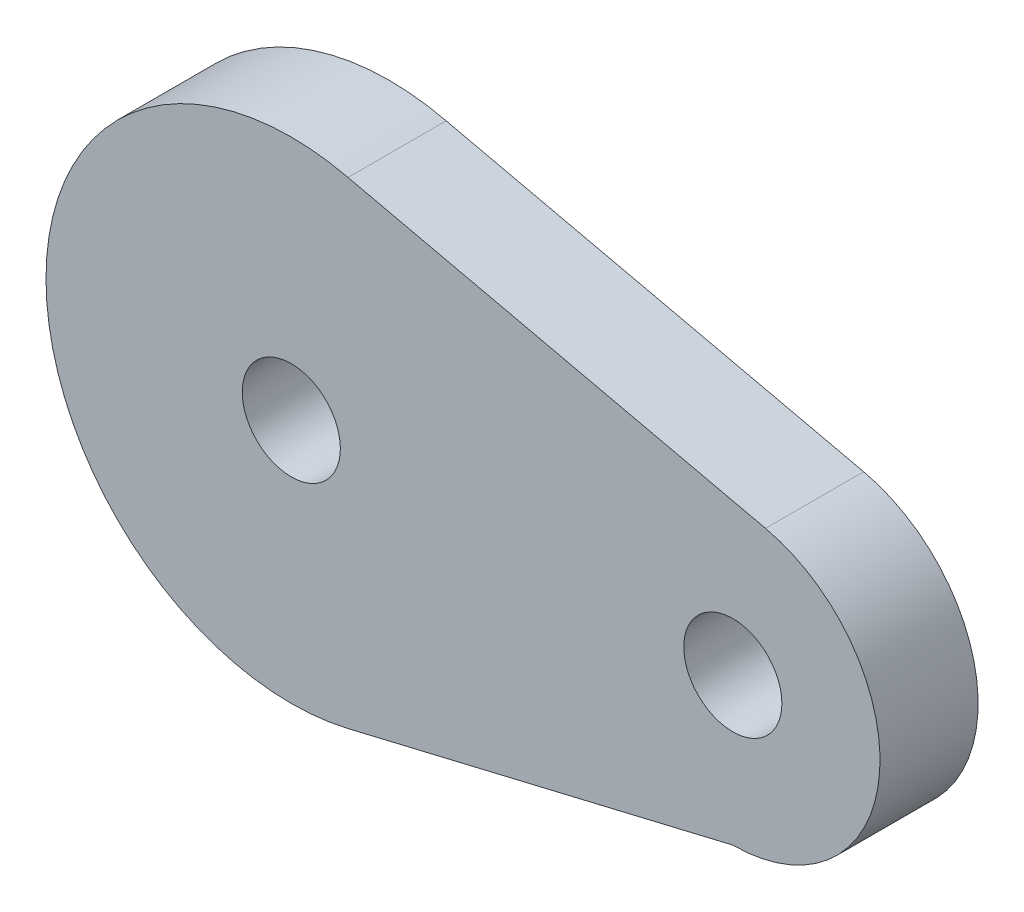
ISO-10303-21;
HEADER;
FILE_DESCRIPTION(('STEP AP214'),'2;1');
FILE_NAME('part.step','',(''),(''),'','','');
FILE_SCHEMA(('AUTOMOTIVE_DESIGN { 1 0 10303 214 1 1 1 1 }'));
ENDSEC;
DATA;
#1=APPLICATION_CONTEXT('core data for automotive mechanical design processes');
#2=APPLICATION_PROTOCOL_DEFINITION('international standard','automotive_design',2000,#1);
#3=PRODUCT_CONTEXT('',#1,'mechanical');
#4=PRODUCT('Part','Part','',(#3));
#5=PRODUCT_RELATED_PRODUCT_CATEGORY('part','',(#4));
#6=PRODUCT_DEFINITION_FORMATION('','',#4);
#7=PRODUCT_DEFINITION_CONTEXT('part definition',#1,'design');
#8=PRODUCT_DEFINITION('design','',#6,#7);
#9=PRODUCT_DEFINITION_SHAPE('','',#8);
#10=(LENGTH_UNIT() NAMED_UNIT(*) SI_UNIT(.MILLI.,.METRE.));
#11=(NAMED_UNIT(*) PLANE_ANGLE_UNIT() SI_UNIT($,.RADIAN.));
#12=(NAMED_UNIT(*) SI_UNIT($,.STERADIAN.) SOLID_ANGLE_UNIT());
#13=UNCERTAINTY_MEASURE_WITH_UNIT(LENGTH_MEASURE(1.E-05),#10,'distance_accuracy_value','');
#14=(GEOMETRIC_REPRESENTATION_CONTEXT(3) GLOBAL_UNCERTAINTY_ASSIGNED_CONTEXT((#13)) GLOBAL_UNIT_ASSIGNED_CONTEXT((#10,
#11,#12)) REPRESENTATION_CONTEXT('',''));
#15=CARTESIAN_POINT('',(0.,0.,0.));
#16=DIRECTION('',(0.,0.,1.));
#17=DIRECTION('',(1.,0.,0.));
#18=AXIS2_PLACEMENT_3D('',#15,#16,#17);
#19=CARTESIAN_POINT('',(0.,0.,10.));
#20=DIRECTION('',(0.,0.,1.));
#21=DIRECTION('',(1.,0.,0.));
#22=AXIS2_PLACEMENT_3D('',#19,#20,#21);
#23=PLANE('',#22);
#24=CARTESIAN_POINT('',(45.,0.,10.));
#25=DIRECTION('',(0.,0.,1.));
#26=DIRECTION('',(1.,0.,0.));
#27=AXIS2_PLACEMENT_3D('',#24,#25,#26);
#28=CIRCLE('',#27,5.);
#29=CARTESIAN_POINT('',(50.,0.,10.));
#30=VERTEX_POINT('',#29);
#31=EDGE_CURVE('E124',#30,#30,#28,.T.);
#32=ORIENTED_EDGE('',*,*,#31,.F.);
#33=EDGE_LOOP('',(#32));
#34=FACE_BOUND('',#33,.T.);
#35=CARTESIAN_POINT('',(0.,0.,10.));
#36=DIRECTION('',(0.,0.,1.));
#37=DIRECTION('',(1.,0.,0.));
#38=AXIS2_PLACEMENT_3D('',#35,#36,#37);
#39=CIRCLE('',#38,5.);
#40=CARTESIAN_POINT('',(5.,0.,10.));
#41=VERTEX_POINT('',#40);
#42=EDGE_CURVE('E13',#41,#41,#39,.T.);
#43=ORIENTED_EDGE('',*,*,#42,.F.);
#44=EDGE_LOOP('',(#43));
#45=FACE_BOUND('',#44,.T.);
#46=DIRECTION('',(-0.975001521058085,0.22219818616366,0.));
#47=VECTOR('',#46,1.);
#48=CARTESIAN_POINT('',(5.55471431952425,24.3739834428272,10.));
#49=LINE('',#48,#47);
#50=CARTESIAN_POINT('',(48.3329727925334,14.6250228159478,9.99999999999999));
#51=VERTEX_POINT('',#50);
#52=CARTESIAN_POINT('',(5.78145187656567,24.3223110373779,10.));
#53=VERTEX_POINT('',#52);
#54=EDGE_CURVE('E116',#51,#53,#49,.T.);
#55=ORIENTED_EDGE('',*,*,#54,.T.);
#56=CARTESIAN_POINT('',(0.,0.,9.99999999999999));
#57=DIRECTION('',(0.,0.,1.));
#58=DIRECTION('',(1.,0.,0.));
#59=AXIS2_PLACEMENT_3D('',#56,#57,#58);
#60=CIRCLE('',#59,25.);
#61=CARTESIAN_POINT('',(5.78145187656567,-24.3223110373779,9.99999999999999));
#62=VERTEX_POINT('',#61);
#63=EDGE_CURVE('E121',#53,#62,#60,.T.);
#64=ORIENTED_EDGE('',*,*,#63,.T.);
#65=DIRECTION('',(0.972892441495116,0.231258075062627,0.));
#66=VECTOR('',#65,1.);
#67=CARTESIAN_POINT('',(5.78145187656567,-24.3223110373779,10.));
#68=LINE('',#67,#66);
#69=CARTESIAN_POINT('',(45.0000000001009,-14.9999999997242,9.99999999999999));
#70=VERTEX_POINT('',#69);
#71=EDGE_CURVE('E119',#62,#70,#68,.T.);
#72=ORIENTED_EDGE('',*,*,#71,.T.);
#73=CARTESIAN_POINT('',(45.0000000001009,1.74860471300846E-10,9.99999999999999));
#74=DIRECTION('',(0.,0.,1.));
#75=DIRECTION('',(1.,0.,0.));
#76=AXIS2_PLACEMENT_3D('',#73,#74,#75);
#77=CIRCLE('',#76,14.9999999998991);
#78=EDGE_CURVE('E91',#70,#51,#77,.T.);
#79=ORIENTED_EDGE('',*,*,#78,.T.);
#80=EDGE_LOOP('',(#55,#64,#72,#79));
#81=FACE_BOUND('',#80,.T.);
#82=ADVANCED_FACE('F45',(#34,#45,#81),#23,.T.);
#83=CARTESIAN_POINT('',(0.,0.,0.));
#84=DIRECTION('',(0.,0.,1.));
#85=DIRECTION('',(1.,0.,0.));
#86=AXIS2_PLACEMENT_3D('',#83,#84,#85);
#87=PLANE('',#86);
#88=CARTESIAN_POINT('',(0.,0.,0.));
#89=DIRECTION('',(0.,0.,1.));
#90=DIRECTION('',(1.,0.,0.));
#91=AXIS2_PLACEMENT_3D('',#88,#89,#90);
#92=CIRCLE('',#91,5.);
#93=CARTESIAN_POINT('',(5.,0.,0.));
#94=VERTEX_POINT('',#93);
#95=EDGE_CURVE('E54',#94,#94,#92,.T.);
#96=ORIENTED_EDGE('',*,*,#95,.T.);
#97=EDGE_LOOP('',(#96));
#98=FACE_BOUND('',#97,.T.);
#99=CARTESIAN_POINT('',(45.,0.,0.));
#100=DIRECTION('',(0.,0.,1.));
#101=DIRECTION('',(1.,0.,0.));
#102=AXIS2_PLACEMENT_3D('',#99,#100,#101);
#103=CIRCLE('',#102,5.);
#104=CARTESIAN_POINT('',(50.,0.,0.));
#105=VERTEX_POINT('',#104);
#106=EDGE_CURVE('E49',#105,#105,#103,.T.);
#107=ORIENTED_EDGE('',*,*,#106,.T.);
#108=EDGE_LOOP('',(#107));
#109=FACE_BOUND('',#108,.T.);
#110=CARTESIAN_POINT('',(0.,0.,0.));
#111=DIRECTION('',(0.,0.,-1.));
#112=DIRECTION('',(-1.,0.,0.));
#113=AXIS2_PLACEMENT_3D('',#110,#111,#112);
#114=CIRCLE('',#113,25.);
#115=CARTESIAN_POINT('',(5.78145187656567,-24.3223110373779,0.));
#116=VERTEX_POINT('',#115);
#117=CARTESIAN_POINT('',(5.78145187656567,24.3223110373779,0.));
#118=VERTEX_POINT('',#117);
#119=EDGE_CURVE('E108',#116,#118,#114,.T.);
#120=ORIENTED_EDGE('',*,*,#119,.T.);
#121=DIRECTION('',(0.975001521058085,-0.222198186163659,0.));
#122=VECTOR('',#121,1.);
#123=CARTESIAN_POINT('',(5.78145187656567,24.3223110373779,0.));
#124=LINE('',#123,#122);
#125=CARTESIAN_POINT('',(48.3329727925334,14.6250228159478,0.));
#126=VERTEX_POINT('',#125);
#127=EDGE_CURVE('E106',#118,#126,#124,.T.);
#128=ORIENTED_EDGE('',*,*,#127,.T.);
#129=CARTESIAN_POINT('',(45.0000000001009,1.74860471300846E-10,0.));
#130=DIRECTION('',(0.,0.,-1.));
#131=DIRECTION('',(-1.,0.,0.));
#132=AXIS2_PLACEMENT_3D('',#129,#130,#131);
#133=CIRCLE('',#132,14.9999999998991);
#134=CARTESIAN_POINT('',(45.0000000001009,-14.9999999997242,0.));
#135=VERTEX_POINT('',#134);
#136=EDGE_CURVE('E70',#126,#135,#133,.T.);
#137=ORIENTED_EDGE('',*,*,#136,.T.);
#138=DIRECTION('',(-0.972892441495116,-0.231258075062627,0.));
#139=VECTOR('',#138,1.);
#140=CARTESIAN_POINT('',(5.78145187656567,-24.3223110373779,0.));
#141=LINE('',#140,#139);
#142=EDGE_CURVE('E98',#135,#116,#141,.T.);
#143=ORIENTED_EDGE('',*,*,#142,.T.);
#144=EDGE_LOOP('',(#120,#128,#137,#143));
#145=FACE_BOUND('',#144,.T.);
#146=ADVANCED_FACE('F47',(#98,#109,#145),#87,.F.);
#147=CARTESIAN_POINT('',(0.,0.,10.));
#148=DIRECTION('',(0.,0.,-1.));
#149=DIRECTION('',(-1.,0.,0.));
#150=AXIS2_PLACEMENT_3D('',#147,#148,#149);
#151=CYLINDRICAL_SURFACE('',#150,5.);
#152=ORIENTED_EDGE('',*,*,#42,.T.);
#153=EDGE_LOOP('',(#152));
#154=FACE_BOUND('',#153,.T.);
#155=ORIENTED_EDGE('',*,*,#95,.F.);
#156=EDGE_LOOP('',(#155));
#157=FACE_BOUND('',#156,.T.);
#158=ADVANCED_FACE('F135',(#154,#157),#151,.F.);
#159=CARTESIAN_POINT('',(45.,0.,-22.));
#160=DIRECTION('',(0.,0.,1.));
#161=DIRECTION('',(1.,0.,0.));
#162=AXIS2_PLACEMENT_3D('',#159,#160,#161);
#163=CYLINDRICAL_SURFACE('',#162,5.);
#164=ORIENTED_EDGE('',*,*,#31,.T.);
#165=EDGE_LOOP('',(#164));
#166=FACE_BOUND('',#165,.T.);
#167=ORIENTED_EDGE('',*,*,#106,.F.);
#168=EDGE_LOOP('',(#167));
#169=FACE_BOUND('',#168,.T.);
#170=ADVANCED_FACE('F133',(#166,#169),#163,.F.);
#171=CARTESIAN_POINT('',(45.0000000001009,1.74860471300846E-10,130.));
#172=DIRECTION('',(0.,0.,-1.));
#173=DIRECTION('',(-1.,0.,0.));
#174=AXIS2_PLACEMENT_3D('',#171,#172,#173);
#175=CYLINDRICAL_SURFACE('',#174,14.9999999998991);
#176=DIRECTION('',(0.,0.,-1.));
#177=VECTOR('',#176,1.);
#178=CARTESIAN_POINT('',(45.0000000001009,-14.9999999997242,130.));
#179=LINE('',#178,#177);
#180=EDGE_CURVE('E88',#70,#135,#179,.T.);
#181=ORIENTED_EDGE('',*,*,#180,.T.);
#182=ORIENTED_EDGE('',*,*,#136,.F.);
#183=DIRECTION('',(0.,0.,-1.));
#184=VECTOR('',#183,1.);
#185=CARTESIAN_POINT('',(48.3329727925334,14.6250228159478,130.));
#186=LINE('',#185,#184);
#187=EDGE_CURVE('E95',#51,#126,#186,.T.);
#188=ORIENTED_EDGE('',*,*,#187,.F.);
#189=ORIENTED_EDGE('',*,*,#78,.F.);
#190=EDGE_LOOP('',(#181,#182,#188,#189));
#191=FACE_BOUND('',#190,.T.);
#192=ADVANCED_FACE('F90',(#191),#175,.T.);
#193=CARTESIAN_POINT('',(0.,0.,130.));
#194=DIRECTION('',(0.,0.,-1.));
#195=DIRECTION('',(-1.,0.,0.));
#196=AXIS2_PLACEMENT_3D('',#193,#194,#195);
#197=CYLINDRICAL_SURFACE('',#196,25.);
#198=DIRECTION('',(0.,0.,-1.));
#199=VECTOR('',#198,1.);
#200=CARTESIAN_POINT('',(5.78145187656567,24.3223110373779,130.));
#201=LINE('',#200,#199);
#202=EDGE_CURVE('E62',#53,#118,#201,.T.);
#203=ORIENTED_EDGE('',*,*,#202,.T.);
#204=ORIENTED_EDGE('',*,*,#119,.F.);
#205=DIRECTION('',(0.,0.,-1.));
#206=VECTOR('',#205,1.);
#207=CARTESIAN_POINT('',(5.78145187656567,-24.3223110373779,130.));
#208=LINE('',#207,#206);
#209=EDGE_CURVE('E94',#62,#116,#208,.T.);
#210=ORIENTED_EDGE('',*,*,#209,.F.);
#211=ORIENTED_EDGE('',*,*,#63,.F.);
#212=EDGE_LOOP('',(#203,#204,#210,#211));
#213=FACE_BOUND('',#212,.T.);
#214=ADVANCED_FACE('F142',(#213),#197,.T.);
#215=CARTESIAN_POINT('',(5.78145187656567,-24.3223110373779,130.));
#216=DIRECTION('',(0.231258075062627,-0.972892441495116,0.));
#217=DIRECTION('',(0.972892441495116,0.231258075062627,0.));
#218=AXIS2_PLACEMENT_3D('',#215,#216,#217);
#219=PLANE('',#218);
#220=ORIENTED_EDGE('',*,*,#209,.T.);
#221=ORIENTED_EDGE('',*,*,#142,.F.);
#222=ORIENTED_EDGE('',*,*,#180,.F.);
#223=ORIENTED_EDGE('',*,*,#71,.F.);
#224=EDGE_LOOP('',(#220,#221,#222,#223));
#225=FACE_BOUND('',#224,.T.);
#226=ADVANCED_FACE('F99',(#225),#219,.T.);
#227=CARTESIAN_POINT('',(5.78145187656567,24.3223110373779,130.));
#228=DIRECTION('',(0.222198186163659,0.975001521058085,0.));
#229=DIRECTION('',(-0.975001521058085,0.22219818616366,0.));
#230=AXIS2_PLACEMENT_3D('',#227,#228,#229);
#231=PLANE('',#230);
#232=ORIENTED_EDGE('',*,*,#187,.T.);
#233=ORIENTED_EDGE('',*,*,#127,.F.);
#234=ORIENTED_EDGE('',*,*,#202,.F.);
#235=ORIENTED_EDGE('',*,*,#54,.F.);
#236=EDGE_LOOP('',(#232,#233,#234,#235));
#237=FACE_BOUND('',#236,.T.);
#238=ADVANCED_FACE('F156',(#237),#231,.T.);
#239=CLOSED_SHELL('',(#82,#146,#158,#170,#192,#214,#226,#238));
#240=MANIFOLD_SOLID_BREP('B2',#239);
#241=ADVANCED_BREP_SHAPE_REPRESENTATION('',(#18,#240),#14);
#242=SHAPE_DEFINITION_REPRESENTATION(#9,#241);
ENDSEC;
END-ISO-10303-21;
